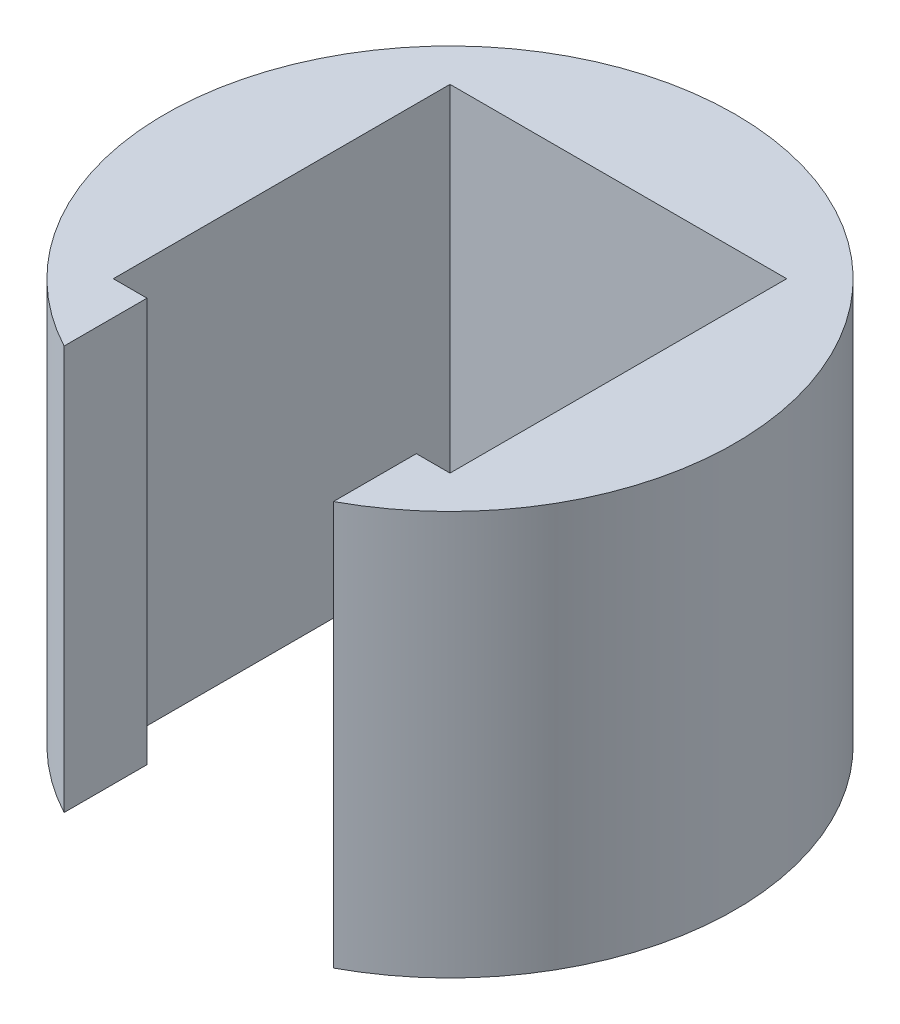
ISO-10303-21;
HEADER;
FILE_DESCRIPTION(('STEP AP214'),'2;1');
FILE_NAME('part.step','',(''),(''),'','','');
FILE_SCHEMA(('AUTOMOTIVE_DESIGN { 1 0 10303 214 1 1 1 1 }'));
ENDSEC;
DATA;
#1=APPLICATION_CONTEXT('core data for automotive mechanical design processes');
#2=APPLICATION_PROTOCOL_DEFINITION('international standard','automotive_design',2000,#1);
#3=PRODUCT_CONTEXT('',#1,'mechanical');
#4=PRODUCT('Part','Part','',(#3));
#5=PRODUCT_RELATED_PRODUCT_CATEGORY('part','',(#4));
#6=PRODUCT_DEFINITION_FORMATION('','',#4);
#7=PRODUCT_DEFINITION_CONTEXT('part definition',#1,'design');
#8=PRODUCT_DEFINITION('design','',#6,#7);
#9=PRODUCT_DEFINITION_SHAPE('','',#8);
#10=(LENGTH_UNIT() NAMED_UNIT(*) SI_UNIT(.MILLI.,.METRE.));
#11=(NAMED_UNIT(*) PLANE_ANGLE_UNIT() SI_UNIT($,.RADIAN.));
#12=(NAMED_UNIT(*) SI_UNIT($,.STERADIAN.) SOLID_ANGLE_UNIT());
#13=UNCERTAINTY_MEASURE_WITH_UNIT(LENGTH_MEASURE(1.E-05),#10,'distance_accuracy_value','');
#14=(GEOMETRIC_REPRESENTATION_CONTEXT(3) GLOBAL_UNCERTAINTY_ASSIGNED_CONTEXT((#13)) GLOBAL_UNIT_ASSIGNED_CONTEXT((#10,
#11,#12)) REPRESENTATION_CONTEXT('',''));
#15=CARTESIAN_POINT('',(0.,0.,0.));
#16=DIRECTION('',(0.,0.,1.));
#17=DIRECTION('',(1.,0.,0.));
#18=AXIS2_PLACEMENT_3D('',#15,#16,#17);
#19=CARTESIAN_POINT('',(7.5,18.,-7.5));
#20=DIRECTION('',(1.,0.,0.));
#21=DIRECTION('',(0.,0.,-1.));
#22=AXIS2_PLACEMENT_3D('',#19,#20,#21);
#23=PLANE('',#22);
#24=DIRECTION('',(0.,0.,1.));
#25=VECTOR('',#24,1.);
#26=CARTESIAN_POINT('',(7.5,0.,-7.5));
#27=LINE('',#26,#25);
#28=CARTESIAN_POINT('',(7.5,0.,-7.5));
#29=VERTEX_POINT('',#28);
#30=CARTESIAN_POINT('',(7.5,0.,7.5));
#31=VERTEX_POINT('',#30);
#32=EDGE_CURVE('E140',#29,#31,#27,.T.);
#33=ORIENTED_EDGE('',*,*,#32,.T.);
#34=DIRECTION('',(0.,-1.,0.));
#35=VECTOR('',#34,1.);
#36=CARTESIAN_POINT('',(7.5,18.,7.5));
#37=LINE('',#36,#35);
#38=CARTESIAN_POINT('',(7.5,18.,7.5));
#39=VERTEX_POINT('',#38);
#40=EDGE_CURVE('E11',#39,#31,#37,.T.);
#41=ORIENTED_EDGE('',*,*,#40,.F.);
#42=DIRECTION('',(0.,0.,1.));
#43=VECTOR('',#42,1.);
#44=CARTESIAN_POINT('',(7.5,18.,-7.5));
#45=LINE('',#44,#43);
#46=CARTESIAN_POINT('',(7.5,18.,-7.5));
#47=VERTEX_POINT('',#46);
#48=EDGE_CURVE('E162',#47,#39,#45,.T.);
#49=ORIENTED_EDGE('',*,*,#48,.F.);
#50=DIRECTION('',(0.,-1.,0.));
#51=VECTOR('',#50,1.);
#52=CARTESIAN_POINT('',(7.5,18.,-7.5));
#53=LINE('',#52,#51);
#54=EDGE_CURVE('E136',#47,#29,#53,.T.);
#55=ORIENTED_EDGE('',*,*,#54,.T.);
#56=EDGE_LOOP('',(#33,#41,#49,#55));
#57=FACE_BOUND('',#56,.T.);
#58=ADVANCED_FACE('F39',(#57),#23,.F.);
#59=CARTESIAN_POINT('',(5.99964317105099,18.,7.5));
#60=DIRECTION('',(0.,0.,1.));
#61=DIRECTION('',(1.,0.,0.));
#62=AXIS2_PLACEMENT_3D('',#59,#60,#61);
#63=PLANE('',#62);
#64=DIRECTION('',(-1.,0.,0.));
#65=VECTOR('',#64,1.);
#66=CARTESIAN_POINT('',(5.99964317105099,0.,7.5));
#67=LINE('',#66,#65);
#68=CARTESIAN_POINT('',(5.99964317105099,0.,7.5));
#69=VERTEX_POINT('',#68);
#70=EDGE_CURVE('E144',#31,#69,#67,.T.);
#71=ORIENTED_EDGE('',*,*,#70,.T.);
#72=DIRECTION('',(0.,-1.,0.));
#73=VECTOR('',#72,1.);
#74=CARTESIAN_POINT('',(5.99964317105099,18.,7.5));
#75=LINE('',#74,#73);
#76=CARTESIAN_POINT('',(5.99964317105099,18.,7.5));
#77=VERTEX_POINT('',#76);
#78=EDGE_CURVE('E48',#77,#69,#75,.T.);
#79=ORIENTED_EDGE('',*,*,#78,.F.);
#80=DIRECTION('',(-1.,0.,0.));
#81=VECTOR('',#80,1.);
#82=CARTESIAN_POINT('',(5.99964317105099,18.,7.5));
#83=LINE('',#82,#81);
#84=EDGE_CURVE('E99',#39,#77,#83,.T.);
#85=ORIENTED_EDGE('',*,*,#84,.F.);
#86=ORIENTED_EDGE('',*,*,#40,.T.);
#87=EDGE_LOOP('',(#71,#79,#85,#86));
#88=FACE_BOUND('',#87,.T.);
#89=ADVANCED_FACE('F208',(#88),#63,.F.);
#90=CARTESIAN_POINT('',(5.99964317105099,18.,11.1934928337879));
#91=DIRECTION('',(1.,0.,0.));
#92=DIRECTION('',(0.,0.,-1.));
#93=AXIS2_PLACEMENT_3D('',#90,#91,#92);
#94=PLANE('',#93);
#95=DIRECTION('',(0.,0.,1.));
#96=VECTOR('',#95,1.);
#97=CARTESIAN_POINT('',(5.99964317105099,0.,11.1934928337879));
#98=LINE('',#97,#96);
#99=CARTESIAN_POINT('',(5.99964317105099,0.,11.1934928337879));
#100=VERTEX_POINT('',#99);
#101=EDGE_CURVE('E147',#69,#100,#98,.T.);
#102=ORIENTED_EDGE('',*,*,#101,.T.);
#103=DIRECTION('',(0.,-1.,0.));
#104=VECTOR('',#103,1.);
#105=CARTESIAN_POINT('',(5.99964317105099,18.,11.1934928337879));
#106=LINE('',#105,#104);
#107=CARTESIAN_POINT('',(5.99964317105099,18.,11.1934928337879));
#108=VERTEX_POINT('',#107);
#109=EDGE_CURVE('E173',#108,#100,#106,.T.);
#110=ORIENTED_EDGE('',*,*,#109,.F.);
#111=DIRECTION('',(0.,0.,1.));
#112=VECTOR('',#111,1.);
#113=CARTESIAN_POINT('',(5.99964317105099,18.,11.1934928337879));
#114=LINE('',#113,#112);
#115=EDGE_CURVE('E183',#77,#108,#114,.T.);
#116=ORIENTED_EDGE('',*,*,#115,.F.);
#117=ORIENTED_EDGE('',*,*,#78,.T.);
#118=EDGE_LOOP('',(#102,#110,#116,#117));
#119=FACE_BOUND('',#118,.T.);
#120=ADVANCED_FACE('F181',(#119),#94,.F.);
#121=CARTESIAN_POINT('',(0.,18.,0.));
#122=DIRECTION('',(0.,-1.,0.));
#123=DIRECTION('',(0.,0.,-1.));
#124=AXIS2_PLACEMENT_3D('',#121,#122,#123);
#125=CYLINDRICAL_SURFACE('',#124,12.7);
#126=CARTESIAN_POINT('',(0.,0.,0.));
#127=DIRECTION('',(0.,1.,0.));
#128=DIRECTION('',(0.,0.,1.));
#129=AXIS2_PLACEMENT_3D('',#126,#127,#128);
#130=CIRCLE('',#129,12.7);
#131=CARTESIAN_POINT('',(-5.99964317105099,0.,11.1934928337879));
#132=VERTEX_POINT('',#131);
#133=EDGE_CURVE('E150',#100,#132,#130,.T.);
#134=ORIENTED_EDGE('',*,*,#133,.T.);
#135=DIRECTION('',(0.,-1.,0.));
#136=VECTOR('',#135,1.);
#137=CARTESIAN_POINT('',(-5.99964317105099,18.,11.1934928337879));
#138=LINE('',#137,#136);
#139=CARTESIAN_POINT('',(-5.99964317105099,18.,11.1934928337879));
#140=VERTEX_POINT('',#139);
#141=EDGE_CURVE('E169',#140,#132,#138,.T.);
#142=ORIENTED_EDGE('',*,*,#141,.F.);
#143=CARTESIAN_POINT('',(0.,18.,0.));
#144=DIRECTION('',(0.,1.,0.));
#145=DIRECTION('',(0.,0.,1.));
#146=AXIS2_PLACEMENT_3D('',#143,#144,#145);
#147=CIRCLE('',#146,12.7);
#148=EDGE_CURVE('E196',#108,#140,#147,.T.);
#149=ORIENTED_EDGE('',*,*,#148,.F.);
#150=ORIENTED_EDGE('',*,*,#109,.T.);
#151=EDGE_LOOP('',(#134,#142,#149,#150));
#152=FACE_BOUND('',#151,.T.);
#153=ADVANCED_FACE('F191',(#152),#125,.T.);
#154=CARTESIAN_POINT('',(-5.99964317105099,18.,7.5));
#155=DIRECTION('',(-1.,0.,0.));
#156=DIRECTION('',(0.,0.,1.));
#157=AXIS2_PLACEMENT_3D('',#154,#155,#156);
#158=PLANE('',#157);
#159=DIRECTION('',(0.,0.,-1.));
#160=VECTOR('',#159,1.);
#161=CARTESIAN_POINT('',(-5.99964317105099,0.,7.5));
#162=LINE('',#161,#160);
#163=CARTESIAN_POINT('',(-5.99964317105099,0.,7.5));
#164=VERTEX_POINT('',#163);
#165=EDGE_CURVE('E153',#132,#164,#162,.T.);
#166=ORIENTED_EDGE('',*,*,#165,.T.);
#167=DIRECTION('',(0.,-1.,0.));
#168=VECTOR('',#167,1.);
#169=CARTESIAN_POINT('',(-5.99964317105099,18.,7.5));
#170=LINE('',#169,#168);
#171=CARTESIAN_POINT('',(-5.99964317105099,18.,7.5));
#172=VERTEX_POINT('',#171);
#173=EDGE_CURVE('E129',#172,#164,#170,.T.);
#174=ORIENTED_EDGE('',*,*,#173,.F.);
#175=DIRECTION('',(0.,0.,-1.));
#176=VECTOR('',#175,1.);
#177=CARTESIAN_POINT('',(-5.99964317105099,18.,7.5));
#178=LINE('',#177,#176);
#179=EDGE_CURVE('E118',#140,#172,#178,.T.);
#180=ORIENTED_EDGE('',*,*,#179,.F.);
#181=ORIENTED_EDGE('',*,*,#141,.T.);
#182=EDGE_LOOP('',(#166,#174,#180,#181));
#183=FACE_BOUND('',#182,.T.);
#184=ADVANCED_FACE('F194',(#183),#158,.F.);
#185=CARTESIAN_POINT('',(-7.5,18.,7.5));
#186=DIRECTION('',(0.,0.,1.));
#187=DIRECTION('',(1.,0.,0.));
#188=AXIS2_PLACEMENT_3D('',#185,#186,#187);
#189=PLANE('',#188);
#190=DIRECTION('',(-1.,0.,0.));
#191=VECTOR('',#190,1.);
#192=CARTESIAN_POINT('',(-7.5,0.,7.5));
#193=LINE('',#192,#191);
#194=CARTESIAN_POINT('',(-7.5,0.,7.5));
#195=VERTEX_POINT('',#194);
#196=EDGE_CURVE('E127',#164,#195,#193,.T.);
#197=ORIENTED_EDGE('',*,*,#196,.T.);
#198=DIRECTION('',(0.,-1.,0.));
#199=VECTOR('',#198,1.);
#200=CARTESIAN_POINT('',(-7.5,18.,7.5));
#201=LINE('',#200,#199);
#202=CARTESIAN_POINT('',(-7.5,18.,7.5));
#203=VERTEX_POINT('',#202);
#204=EDGE_CURVE('E124',#203,#195,#201,.T.);
#205=ORIENTED_EDGE('',*,*,#204,.F.);
#206=DIRECTION('',(-1.,0.,0.));
#207=VECTOR('',#206,1.);
#208=CARTESIAN_POINT('',(-7.5,18.,7.5));
#209=LINE('',#208,#207);
#210=EDGE_CURVE('E112',#172,#203,#209,.T.);
#211=ORIENTED_EDGE('',*,*,#210,.F.);
#212=ORIENTED_EDGE('',*,*,#173,.T.);
#213=EDGE_LOOP('',(#197,#205,#211,#212));
#214=FACE_BOUND('',#213,.T.);
#215=ADVANCED_FACE('F125',(#214),#189,.F.);
#216=CARTESIAN_POINT('',(-7.5,18.,-7.5));
#217=DIRECTION('',(-1.,0.,0.));
#218=DIRECTION('',(0.,0.,1.));
#219=AXIS2_PLACEMENT_3D('',#216,#217,#218);
#220=PLANE('',#219);
#221=DIRECTION('',(0.,0.,-1.));
#222=VECTOR('',#221,1.);
#223=CARTESIAN_POINT('',(-7.5,0.,-7.5));
#224=LINE('',#223,#222);
#225=CARTESIAN_POINT('',(-7.5,0.,-7.5));
#226=VERTEX_POINT('',#225);
#227=EDGE_CURVE('E85',#195,#226,#224,.T.);
#228=ORIENTED_EDGE('',*,*,#227,.T.);
#229=DIRECTION('',(0.,-1.,0.));
#230=VECTOR('',#229,1.);
#231=CARTESIAN_POINT('',(-7.5,18.,-7.5));
#232=LINE('',#231,#230);
#233=CARTESIAN_POINT('',(-7.5,18.,-7.5));
#234=VERTEX_POINT('',#233);
#235=EDGE_CURVE('E130',#234,#226,#232,.T.);
#236=ORIENTED_EDGE('',*,*,#235,.F.);
#237=DIRECTION('',(0.,0.,-1.));
#238=VECTOR('',#237,1.);
#239=CARTESIAN_POINT('',(-7.5,18.,-7.5));
#240=LINE('',#239,#238);
#241=EDGE_CURVE('E116',#203,#234,#240,.T.);
#242=ORIENTED_EDGE('',*,*,#241,.F.);
#243=ORIENTED_EDGE('',*,*,#204,.T.);
#244=EDGE_LOOP('',(#228,#236,#242,#243));
#245=FACE_BOUND('',#244,.T.);
#246=ADVANCED_FACE('F132',(#245),#220,.F.);
#247=CARTESIAN_POINT('',(-7.5,18.,-7.5));
#248=DIRECTION('',(0.,0.,-1.));
#249=DIRECTION('',(-1.,0.,0.));
#250=AXIS2_PLACEMENT_3D('',#247,#248,#249);
#251=PLANE('',#250);
#252=DIRECTION('',(1.,0.,0.));
#253=VECTOR('',#252,1.);
#254=CARTESIAN_POINT('',(-7.5,0.,-7.5));
#255=LINE('',#254,#253);
#256=EDGE_CURVE('E91',#226,#29,#255,.T.);
#257=ORIENTED_EDGE('',*,*,#256,.T.);
#258=ORIENTED_EDGE('',*,*,#54,.F.);
#259=DIRECTION('',(1.,0.,0.));
#260=VECTOR('',#259,1.);
#261=CARTESIAN_POINT('',(-7.5,18.,-7.5));
#262=LINE('',#261,#260);
#263=EDGE_CURVE('E56',#234,#47,#262,.T.);
#264=ORIENTED_EDGE('',*,*,#263,.F.);
#265=ORIENTED_EDGE('',*,*,#235,.T.);
#266=EDGE_LOOP('',(#257,#258,#264,#265));
#267=FACE_BOUND('',#266,.T.);
#268=ADVANCED_FACE('F224',(#267),#251,.F.);
#269=CARTESIAN_POINT('',(0.,18.,0.));
#270=DIRECTION('',(0.,1.,0.));
#271=DIRECTION('',(0.,0.,1.));
#272=AXIS2_PLACEMENT_3D('',#269,#270,#271);
#273=PLANE('',#272);
#274=ORIENTED_EDGE('',*,*,#48,.T.);
#275=ORIENTED_EDGE('',*,*,#84,.T.);
#276=ORIENTED_EDGE('',*,*,#115,.T.);
#277=ORIENTED_EDGE('',*,*,#148,.T.);
#278=ORIENTED_EDGE('',*,*,#179,.T.);
#279=ORIENTED_EDGE('',*,*,#210,.T.);
#280=ORIENTED_EDGE('',*,*,#241,.T.);
#281=ORIENTED_EDGE('',*,*,#263,.T.);
#282=EDGE_LOOP('',(#274,#275,#276,#277,#278,#279,#280,#281));
#283=FACE_BOUND('',#282,.T.);
#284=ADVANCED_FACE('F114',(#283),#273,.T.);
#285=CARTESIAN_POINT('',(0.,0.,0.));
#286=DIRECTION('',(0.,1.,0.));
#287=DIRECTION('',(0.,0.,1.));
#288=AXIS2_PLACEMENT_3D('',#285,#286,#287);
#289=PLANE('',#288);
#290=ORIENTED_EDGE('',*,*,#32,.F.);
#291=ORIENTED_EDGE('',*,*,#256,.F.);
#292=ORIENTED_EDGE('',*,*,#227,.F.);
#293=ORIENTED_EDGE('',*,*,#196,.F.);
#294=ORIENTED_EDGE('',*,*,#165,.F.);
#295=ORIENTED_EDGE('',*,*,#133,.F.);
#296=ORIENTED_EDGE('',*,*,#101,.F.);
#297=ORIENTED_EDGE('',*,*,#70,.F.);
#298=EDGE_LOOP('',(#290,#291,#292,#293,#294,#295,#296,#297));
#299=FACE_BOUND('',#298,.T.);
#300=ADVANCED_FACE('F187',(#299),#289,.F.);
#301=CLOSED_SHELL('',(#58,#89,#120,#153,#184,#215,#246,#268,#284,#300));
#302=MANIFOLD_SOLID_BREP('B2',#301);
#303=ADVANCED_BREP_SHAPE_REPRESENTATION('',(#18,#302),#14);
#304=SHAPE_DEFINITION_REPRESENTATION(#9,#303);
ENDSEC;
END-ISO-10303-21;
